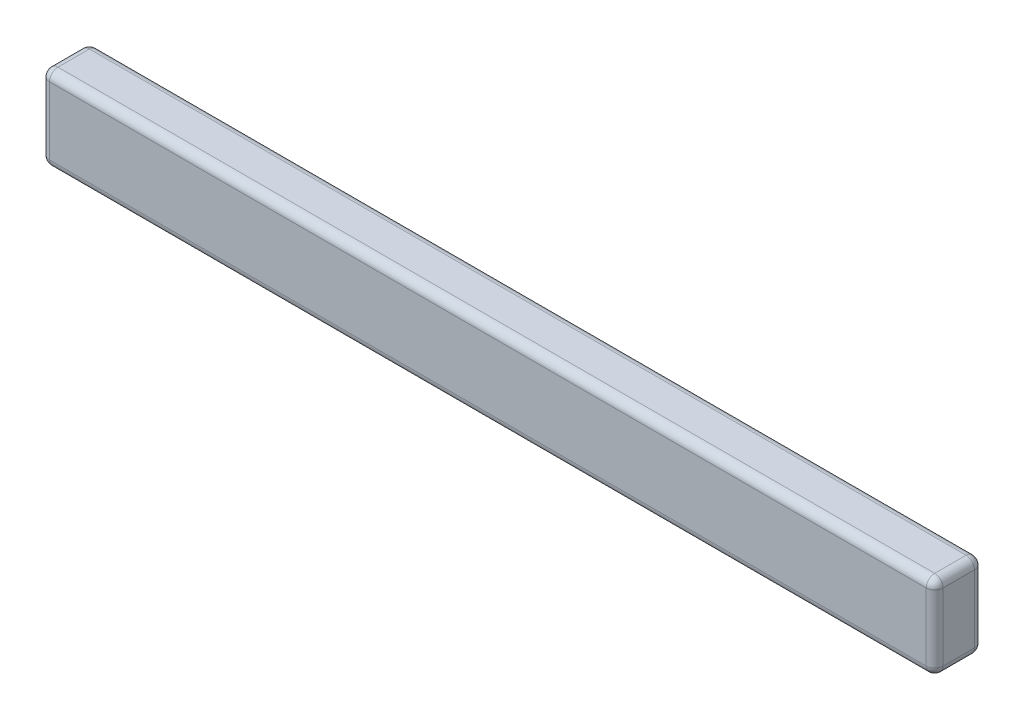
ISO-10303-21;
HEADER;
FILE_DESCRIPTION(('STEP AP214'),'2;1');
FILE_NAME('part.step','',(''),(''),'','','');
FILE_SCHEMA(('AUTOMOTIVE_DESIGN { 1 0 10303 214 1 1 1 1 }'));
ENDSEC;
DATA;
#1=APPLICATION_CONTEXT('core data for automotive mechanical design processes');
#2=APPLICATION_PROTOCOL_DEFINITION('international standard','automotive_design',2000,#1);
#3=PRODUCT_CONTEXT('',#1,'mechanical');
#4=PRODUCT('Part','Part','',(#3));
#5=PRODUCT_RELATED_PRODUCT_CATEGORY('part','',(#4));
#6=PRODUCT_DEFINITION_FORMATION('','',#4);
#7=PRODUCT_DEFINITION_CONTEXT('part definition',#1,'design');
#8=PRODUCT_DEFINITION('design','',#6,#7);
#9=PRODUCT_DEFINITION_SHAPE('','',#8);
#10=(LENGTH_UNIT() NAMED_UNIT(*) SI_UNIT(.MILLI.,.METRE.));
#11=(NAMED_UNIT(*) PLANE_ANGLE_UNIT() SI_UNIT($,.RADIAN.));
#12=(NAMED_UNIT(*) SI_UNIT($,.STERADIAN.) SOLID_ANGLE_UNIT());
#13=UNCERTAINTY_MEASURE_WITH_UNIT(LENGTH_MEASURE(1.E-05),#10,'distance_accuracy_value','');
#14=(GEOMETRIC_REPRESENTATION_CONTEXT(3) GLOBAL_UNCERTAINTY_ASSIGNED_CONTEXT((#13)) GLOBAL_UNIT_ASSIGNED_CONTEXT((#10,
#11,#12)) REPRESENTATION_CONTEXT('',''));
#15=CARTESIAN_POINT('',(0.,0.,0.));
#16=DIRECTION('',(0.,0.,1.));
#17=DIRECTION('',(1.,0.,0.));
#18=AXIS2_PLACEMENT_3D('',#15,#16,#17);
#19=CARTESIAN_POINT('',(2399.83953907813,-324.547034379125,200.));
#20=DIRECTION('',(-1.,0.,0.));
#21=DIRECTION('',(0.,0.,1.));
#22=AXIS2_PLACEMENT_3D('',#19,#20,#21);
#23=PLANE('',#22);
#24=DIRECTION('',(0.,0.,-1.));
#25=VECTOR('',#24,1.);
#26=CARTESIAN_POINT('',(2399.83953907813,-359.547034379125,200.));
#27=LINE('',#26,#25);
#28=CARTESIAN_POINT('',(2399.83953907813,-359.547034379125,35.));
#29=VERTEX_POINT('',#28);
#30=CARTESIAN_POINT('',(2399.83953907813,-359.547034379125,165.));
#31=VERTEX_POINT('',#30);
#32=EDGE_CURVE('E142',#29,#31,#27,.F.);
#33=ORIENTED_EDGE('',*,*,#32,.T.);
#34=DIRECTION('',(0.,1.,0.));
#35=VECTOR('',#34,1.);
#36=CARTESIAN_POINT('',(2399.83953907813,-674.547034379125,165.));
#37=LINE('',#36,#35);
#38=CARTESIAN_POINT('',(2399.83953907813,-639.547034379125,165.));
#39=VERTEX_POINT('',#38);
#40=EDGE_CURVE('E188',#31,#39,#37,.F.);
#41=ORIENTED_EDGE('',*,*,#40,.T.);
#42=DIRECTION('',(0.,0.,-1.));
#43=VECTOR('',#42,1.);
#44=CARTESIAN_POINT('',(2399.83953907813,-639.547034379125,200.));
#45=LINE('',#44,#43);
#46=CARTESIAN_POINT('',(2399.83953907813,-639.547034379125,35.));
#47=VERTEX_POINT('',#46);
#48=EDGE_CURVE('E183',#39,#47,#45,.T.);
#49=ORIENTED_EDGE('',*,*,#48,.T.);
#50=DIRECTION('',(0.,1.,0.));
#51=VECTOR('',#50,1.);
#52=CARTESIAN_POINT('',(2399.83953907813,-324.547034379125,35.));
#53=LINE('',#52,#51);
#54=EDGE_CURVE('E177',#47,#29,#53,.T.);
#55=ORIENTED_EDGE('',*,*,#54,.T.);
#56=EDGE_LOOP('',(#33,#41,#49,#55));
#57=FACE_BOUND('',#56,.T.);
#58=ADVANCED_FACE('F45',(#57),#23,.F.);
#59=CARTESIAN_POINT('',(-1300.16046092187,-324.547034379125,200.));
#60=DIRECTION('',(0.,-1.,0.));
#61=DIRECTION('',(1.,0.,0.));
#62=AXIS2_PLACEMENT_3D('',#59,#60,#61);
#63=PLANE('',#62);
#64=DIRECTION('',(0.,0.,-1.));
#65=VECTOR('',#64,1.);
#66=CARTESIAN_POINT('',(-1265.16046092187,-324.547034379125,200.));
#67=LINE('',#66,#65);
#68=CARTESIAN_POINT('',(-1265.16046092187,-324.547034379125,35.));
#69=VERTEX_POINT('',#68);
#70=CARTESIAN_POINT('',(-1265.16046092187,-324.547034379125,165.));
#71=VERTEX_POINT('',#70);
#72=EDGE_CURVE('E167',#69,#71,#67,.F.);
#73=ORIENTED_EDGE('',*,*,#72,.T.);
#74=DIRECTION('',(-1.,0.,0.));
#75=VECTOR('',#74,1.);
#76=CARTESIAN_POINT('',(2399.83953907813,-324.547034379125,165.));
#77=LINE('',#76,#75);
#78=CARTESIAN_POINT('',(2364.83953907813,-324.547034379125,165.));
#79=VERTEX_POINT('',#78);
#80=EDGE_CURVE('E171',#71,#79,#77,.F.);
#81=ORIENTED_EDGE('',*,*,#80,.T.);
#82=DIRECTION('',(0.,0.,-1.));
#83=VECTOR('',#82,1.);
#84=CARTESIAN_POINT('',(2364.83953907813,-324.547034379125,200.));
#85=LINE('',#84,#83);
#86=CARTESIAN_POINT('',(2364.83953907813,-324.547034379125,35.));
#87=VERTEX_POINT('',#86);
#88=EDGE_CURVE('E140',#79,#87,#85,.T.);
#89=ORIENTED_EDGE('',*,*,#88,.T.);
#90=DIRECTION('',(-1.,0.,0.));
#91=VECTOR('',#90,1.);
#92=CARTESIAN_POINT('',(-1300.16046092187,-324.547034379125,35.));
#93=LINE('',#92,#91);
#94=EDGE_CURVE('E160',#87,#69,#93,.T.);
#95=ORIENTED_EDGE('',*,*,#94,.T.);
#96=EDGE_LOOP('',(#73,#81,#89,#95));
#97=FACE_BOUND('',#96,.T.);
#98=ADVANCED_FACE('F169',(#97),#63,.F.);
#99=CARTESIAN_POINT('',(-1300.16046092187,-324.547034379125,200.));
#100=DIRECTION('',(1.,0.,0.));
#101=DIRECTION('',(0.,0.,-1.));
#102=AXIS2_PLACEMENT_3D('',#99,#100,#101);
#103=PLANE('',#102);
#104=DIRECTION('',(0.,0.,-1.));
#105=VECTOR('',#104,1.);
#106=CARTESIAN_POINT('',(-1300.16046092187,-639.547034379125,200.));
#107=LINE('',#106,#105);
#108=CARTESIAN_POINT('',(-1300.16046092187,-639.547034379125,35.));
#109=VERTEX_POINT('',#108);
#110=CARTESIAN_POINT('',(-1300.16046092187,-639.547034379125,165.));
#111=VERTEX_POINT('',#110);
#112=EDGE_CURVE('E194',#109,#111,#107,.F.);
#113=ORIENTED_EDGE('',*,*,#112,.T.);
#114=DIRECTION('',(0.,-1.,0.));
#115=VECTOR('',#114,1.);
#116=CARTESIAN_POINT('',(-1300.16046092187,-324.547034379125,165.));
#117=LINE('',#116,#115);
#118=CARTESIAN_POINT('',(-1300.16046092187,-359.547034379125,165.));
#119=VERTEX_POINT('',#118);
#120=EDGE_CURVE('E201',#111,#119,#117,.F.);
#121=ORIENTED_EDGE('',*,*,#120,.T.);
#122=DIRECTION('',(0.,0.,-1.));
#123=VECTOR('',#122,1.);
#124=CARTESIAN_POINT('',(-1300.16046092187,-359.547034379125,200.));
#125=LINE('',#124,#123);
#126=CARTESIAN_POINT('',(-1300.16046092187,-359.547034379125,35.));
#127=VERTEX_POINT('',#126);
#128=EDGE_CURVE('E197',#119,#127,#125,.T.);
#129=ORIENTED_EDGE('',*,*,#128,.T.);
#130=DIRECTION('',(0.,-1.,0.));
#131=VECTOR('',#130,1.);
#132=CARTESIAN_POINT('',(-1300.16046092187,-324.547034379125,35.));
#133=LINE('',#132,#131);
#134=EDGE_CURVE('E191',#127,#109,#133,.T.);
#135=ORIENTED_EDGE('',*,*,#134,.T.);
#136=EDGE_LOOP('',(#113,#121,#129,#135));
#137=FACE_BOUND('',#136,.T.);
#138=ADVANCED_FACE('F340',(#137),#103,.F.);
#139=CARTESIAN_POINT('',(-1300.16046092187,-674.547034379125,200.));
#140=DIRECTION('',(0.,1.,0.));
#141=DIRECTION('',(0.,0.,1.));
#142=AXIS2_PLACEMENT_3D('',#139,#140,#141);
#143=PLANE('',#142);
#144=DIRECTION('',(0.,0.,-1.));
#145=VECTOR('',#144,1.);
#146=CARTESIAN_POINT('',(2364.83953907813,-674.547034379125,200.));
#147=LINE('',#146,#145);
#148=CARTESIAN_POINT('',(2364.83953907813,-674.547034379125,35.));
#149=VERTEX_POINT('',#148);
#150=CARTESIAN_POINT('',(2364.83953907813,-674.547034379125,165.));
#151=VERTEX_POINT('',#150);
#152=EDGE_CURVE('E207',#149,#151,#147,.F.);
#153=ORIENTED_EDGE('',*,*,#152,.T.);
#154=DIRECTION('',(1.,0.,0.));
#155=VECTOR('',#154,1.);
#156=CARTESIAN_POINT('',(-1300.16046092187,-674.547034379125,165.));
#157=LINE('',#156,#155);
#158=CARTESIAN_POINT('',(-1265.16046092187,-674.547034379125,165.));
#159=VERTEX_POINT('',#158);
#160=EDGE_CURVE('E214',#151,#159,#157,.F.);
#161=ORIENTED_EDGE('',*,*,#160,.T.);
#162=DIRECTION('',(0.,0.,-1.));
#163=VECTOR('',#162,1.);
#164=CARTESIAN_POINT('',(-1265.16046092187,-674.547034379125,200.));
#165=LINE('',#164,#163);
#166=CARTESIAN_POINT('',(-1265.16046092187,-674.547034379125,35.));
#167=VERTEX_POINT('',#166);
#168=EDGE_CURVE('E210',#159,#167,#165,.T.);
#169=ORIENTED_EDGE('',*,*,#168,.T.);
#170=DIRECTION('',(1.,0.,0.));
#171=VECTOR('',#170,1.);
#172=CARTESIAN_POINT('',(-1300.16046092187,-674.547034379125,35.));
#173=LINE('',#172,#171);
#174=EDGE_CURVE('E204',#167,#149,#173,.T.);
#175=ORIENTED_EDGE('',*,*,#174,.T.);
#176=EDGE_LOOP('',(#153,#161,#169,#175));
#177=FACE_BOUND('',#176,.T.);
#178=ADVANCED_FACE('F351',(#177),#143,.F.);
#179=CARTESIAN_POINT('',(0.,0.,200.));
#180=DIRECTION('',(0.,0.,1.));
#181=DIRECTION('',(1.,0.,0.));
#182=AXIS2_PLACEMENT_3D('',#179,#180,#181);
#183=PLANE('',#182);
#184=DIRECTION('',(0.,-1.,0.));
#185=VECTOR('',#184,1.);
#186=CARTESIAN_POINT('',(-1265.16046092187,-674.547034379125,200.));
#187=LINE('',#186,#185);
#188=CARTESIAN_POINT('',(-1265.16046092187,-359.547034379125,200.));
#189=VERTEX_POINT('',#188);
#190=CARTESIAN_POINT('',(-1265.16046092187,-639.547034379125,200.));
#191=VERTEX_POINT('',#190);
#192=EDGE_CURVE('E223',#189,#191,#187,.T.);
#193=ORIENTED_EDGE('',*,*,#192,.T.);
#194=DIRECTION('',(1.,0.,0.));
#195=VECTOR('',#194,1.);
#196=CARTESIAN_POINT('',(2399.83953907813,-639.547034379125,200.));
#197=LINE('',#196,#195);
#198=CARTESIAN_POINT('',(2364.83953907813,-639.547034379125,200.));
#199=VERTEX_POINT('',#198);
#200=EDGE_CURVE('E226',#191,#199,#197,.T.);
#201=ORIENTED_EDGE('',*,*,#200,.T.);
#202=DIRECTION('',(0.,1.,0.));
#203=VECTOR('',#202,1.);
#204=CARTESIAN_POINT('',(2364.83953907813,-324.547034379125,200.));
#205=LINE('',#204,#203);
#206=CARTESIAN_POINT('',(2364.83953907813,-359.547034379125,200.));
#207=VERTEX_POINT('',#206);
#208=EDGE_CURVE('E217',#199,#207,#205,.T.);
#209=ORIENTED_EDGE('',*,*,#208,.T.);
#210=DIRECTION('',(-1.,0.,0.));
#211=VECTOR('',#210,1.);
#212=CARTESIAN_POINT('',(-1300.16046092187,-359.547034379125,200.));
#213=LINE('',#212,#211);
#214=EDGE_CURVE('E220',#207,#189,#213,.T.);
#215=ORIENTED_EDGE('',*,*,#214,.T.);
#216=EDGE_LOOP('',(#193,#201,#209,#215));
#217=FACE_BOUND('',#216,.T.);
#218=ADVANCED_FACE('F332',(#217),#183,.T.);
#219=CARTESIAN_POINT('',(0.,0.,0.));
#220=DIRECTION('',(0.,0.,1.));
#221=DIRECTION('',(1.,0.,0.));
#222=AXIS2_PLACEMENT_3D('',#219,#220,#221);
#223=PLANE('',#222);
#224=DIRECTION('',(0.,-1.,0.));
#225=VECTOR('',#224,1.);
#226=CARTESIAN_POINT('',(-1265.16046092187,0.,0.));
#227=LINE('',#226,#225);
#228=CARTESIAN_POINT('',(-1265.16046092187,-639.547034379125,0.));
#229=VERTEX_POINT('',#228);
#230=CARTESIAN_POINT('',(-1265.16046092187,-359.547034379125,0.));
#231=VERTEX_POINT('',#230);
#232=EDGE_CURVE('E55',#229,#231,#227,.F.);
#233=ORIENTED_EDGE('',*,*,#232,.T.);
#234=DIRECTION('',(-1.,0.,0.));
#235=VECTOR('',#234,1.);
#236=CARTESIAN_POINT('',(0.,-359.547034379125,0.));
#237=LINE('',#236,#235);
#238=CARTESIAN_POINT('',(2364.83953907813,-359.547034379125,0.));
#239=VERTEX_POINT('',#238);
#240=EDGE_CURVE('E11',#231,#239,#237,.F.);
#241=ORIENTED_EDGE('',*,*,#240,.T.);
#242=DIRECTION('',(0.,1.,0.));
#243=VECTOR('',#242,1.);
#244=CARTESIAN_POINT('',(2364.83953907813,0.,0.));
#245=LINE('',#244,#243);
#246=CARTESIAN_POINT('',(2364.83953907813,-639.547034379125,0.));
#247=VERTEX_POINT('',#246);
#248=EDGE_CURVE('E230',#239,#247,#245,.F.);
#249=ORIENTED_EDGE('',*,*,#248,.T.);
#250=DIRECTION('',(1.,0.,0.));
#251=VECTOR('',#250,1.);
#252=CARTESIAN_POINT('',(0.,-639.547034379125,0.));
#253=LINE('',#252,#251);
#254=EDGE_CURVE('E66',#247,#229,#253,.F.);
#255=ORIENTED_EDGE('',*,*,#254,.T.);
#256=EDGE_LOOP('',(#233,#241,#249,#255));
#257=FACE_BOUND('',#256,.T.);
#258=ADVANCED_FACE('F577',(#257),#223,.F.);
#259=CARTESIAN_POINT('',(-1265.16046092187,-639.547034379125,200.));
#260=DIRECTION('',(0.,0.,-1.));
#261=DIRECTION('',(-1.,0.,0.));
#262=AXIS2_PLACEMENT_3D('',#259,#260,#261);
#263=CYLINDRICAL_SURFACE('',#262,35.);
#264=CARTESIAN_POINT('',(-1265.16046092187,-639.547034379125,165.));
#265=DIRECTION('',(0.,0.,1.));
#266=DIRECTION('',(1.,0.,0.));
#267=AXIS2_PLACEMENT_3D('',#264,#265,#266);
#268=CIRCLE('',#267,35.);
#269=EDGE_CURVE('E49',#111,#159,#268,.T.);
#270=ORIENTED_EDGE('',*,*,#269,.F.);
#271=ORIENTED_EDGE('',*,*,#112,.F.);
#272=CARTESIAN_POINT('',(-1265.16046092187,-639.547034379125,35.));
#273=DIRECTION('',(0.,0.,-1.));
#274=DIRECTION('',(-1.,0.,0.));
#275=AXIS2_PLACEMENT_3D('',#272,#273,#274);
#276=CIRCLE('',#275,35.);
#277=EDGE_CURVE('E307',#167,#109,#276,.T.);
#278=ORIENTED_EDGE('',*,*,#277,.F.);
#279=ORIENTED_EDGE('',*,*,#168,.F.);
#280=EDGE_LOOP('',(#270,#271,#278,#279));
#281=FACE_BOUND('',#280,.T.);
#282=ADVANCED_FACE('F47',(#281),#263,.T.);
#283=CARTESIAN_POINT('',(-1265.16046092187,-639.547034379125,165.));
#284=DIRECTION('',(0.,-1.,0.));
#285=DIRECTION('',(0.,0.,-1.));
#286=AXIS2_PLACEMENT_3D('',#283,#284,#285);
#287=SPHERICAL_SURFACE('',#286,35.);
#288=CARTESIAN_POINT('',(-1265.16046092187,-639.547034379125,165.));
#289=DIRECTION('',(0.,-1.,0.));
#290=DIRECTION('',(0.,0.,-1.));
#291=AXIS2_PLACEMENT_3D('',#288,#289,#290);
#292=CIRCLE('',#291,35.);
#293=EDGE_CURVE('E300',#111,#191,#292,.F.);
#294=ORIENTED_EDGE('',*,*,#293,.F.);
#295=ORIENTED_EDGE('',*,*,#269,.T.);
#296=CARTESIAN_POINT('',(-1265.16046092187,-639.547034379125,165.));
#297=DIRECTION('',(-1.,0.,0.));
#298=DIRECTION('',(0.,0.,1.));
#299=AXIS2_PLACEMENT_3D('',#296,#297,#298);
#300=CIRCLE('',#299,35.);
#301=EDGE_CURVE('E304',#191,#159,#300,.F.);
#302=ORIENTED_EDGE('',*,*,#301,.F.);
#303=EDGE_LOOP('',(#294,#295,#302));
#304=FACE_BOUND('',#303,.T.);
#305=ADVANCED_FACE('F320',(#304),#287,.T.);
#306=CARTESIAN_POINT('',(-1265.16046092187,-639.547034379125,35.));
#307=DIRECTION('',(-1.,0.,0.));
#308=DIRECTION('',(0.,0.,1.));
#309=AXIS2_PLACEMENT_3D('',#306,#307,#308);
#310=SPHERICAL_SURFACE('',#309,35.);
#311=CARTESIAN_POINT('',(-1265.16046092187,-639.547034379125,35.));
#312=DIRECTION('',(-1.,0.,0.));
#313=DIRECTION('',(0.,0.,1.));
#314=AXIS2_PLACEMENT_3D('',#311,#312,#313);
#315=CIRCLE('',#314,35.);
#316=EDGE_CURVE('E293',#167,#229,#315,.F.);
#317=ORIENTED_EDGE('',*,*,#316,.F.);
#318=ORIENTED_EDGE('',*,*,#277,.T.);
#319=CARTESIAN_POINT('',(-1265.16046092187,-639.547034379125,35.));
#320=DIRECTION('',(0.,-1.,0.));
#321=DIRECTION('',(0.,0.,-1.));
#322=AXIS2_PLACEMENT_3D('',#319,#320,#321);
#323=CIRCLE('',#322,35.);
#324=EDGE_CURVE('E296',#229,#109,#323,.F.);
#325=ORIENTED_EDGE('',*,*,#324,.F.);
#326=EDGE_LOOP('',(#317,#318,#325));
#327=FACE_BOUND('',#326,.T.);
#328=ADVANCED_FACE('F550',(#327),#310,.T.);
#329=CARTESIAN_POINT('',(0.,-639.547034379125,165.));
#330=DIRECTION('',(-1.,0.,0.));
#331=DIRECTION('',(0.,0.,1.));
#332=AXIS2_PLACEMENT_3D('',#329,#330,#331);
#333=CYLINDRICAL_SURFACE('',#332,35.);
#334=ORIENTED_EDGE('',*,*,#301,.T.);
#335=ORIENTED_EDGE('',*,*,#160,.F.);
#336=CARTESIAN_POINT('',(2364.83953907813,-639.547034379125,165.));
#337=DIRECTION('',(1.,0.,0.));
#338=DIRECTION('',(0.,0.,-1.));
#339=AXIS2_PLACEMENT_3D('',#336,#337,#338);
#340=CIRCLE('',#339,35.);
#341=EDGE_CURVE('E285',#199,#151,#340,.T.);
#342=ORIENTED_EDGE('',*,*,#341,.F.);
#343=ORIENTED_EDGE('',*,*,#200,.F.);
#344=EDGE_LOOP('',(#334,#335,#342,#343));
#345=FACE_BOUND('',#344,.T.);
#346=ADVANCED_FACE('F328',(#345),#333,.T.);
#347=CARTESIAN_POINT('',(-1265.16046092187,0.,165.));
#348=DIRECTION('',(0.,1.,0.));
#349=DIRECTION('',(0.,0.,1.));
#350=AXIS2_PLACEMENT_3D('',#347,#348,#349);
#351=CYLINDRICAL_SURFACE('',#350,35.);
#352=ORIENTED_EDGE('',*,*,#293,.T.);
#353=ORIENTED_EDGE('',*,*,#192,.F.);
#354=CARTESIAN_POINT('',(-1265.16046092187,-359.547034379125,165.));
#355=DIRECTION('',(0.,1.,0.));
#356=DIRECTION('',(0.,0.,1.));
#357=AXIS2_PLACEMENT_3D('',#354,#355,#356);
#358=CIRCLE('',#357,35.);
#359=EDGE_CURVE('E281',#119,#189,#358,.T.);
#360=ORIENTED_EDGE('',*,*,#359,.F.);
#361=ORIENTED_EDGE('',*,*,#120,.F.);
#362=EDGE_LOOP('',(#352,#353,#360,#361));
#363=FACE_BOUND('',#362,.T.);
#364=ADVANCED_FACE('F337',(#363),#351,.T.);
#365=CARTESIAN_POINT('',(-1265.16046092187,-359.547034379125,200.));
#366=DIRECTION('',(0.,0.,-1.));
#367=DIRECTION('',(-1.,0.,0.));
#368=AXIS2_PLACEMENT_3D('',#365,#366,#367);
#369=CYLINDRICAL_SURFACE('',#368,35.);
#370=CARTESIAN_POINT('',(-1265.16046092187,-359.547034379125,35.));
#371=DIRECTION('',(0.,0.,-1.));
#372=DIRECTION('',(-1.,0.,0.));
#373=AXIS2_PLACEMENT_3D('',#370,#371,#372);
#374=CIRCLE('',#373,35.);
#375=EDGE_CURVE('E273',#127,#69,#374,.T.);
#376=ORIENTED_EDGE('',*,*,#375,.F.);
#377=ORIENTED_EDGE('',*,*,#128,.F.);
#378=CARTESIAN_POINT('',(-1265.16046092187,-359.547034379125,165.));
#379=DIRECTION('',(0.,0.,1.));
#380=DIRECTION('',(1.,0.,0.));
#381=AXIS2_PLACEMENT_3D('',#378,#379,#380);
#382=CIRCLE('',#381,35.);
#383=EDGE_CURVE('E277',#71,#119,#382,.T.);
#384=ORIENTED_EDGE('',*,*,#383,.F.);
#385=ORIENTED_EDGE('',*,*,#72,.F.);
#386=EDGE_LOOP('',(#376,#377,#384,#385));
#387=FACE_BOUND('',#386,.T.);
#388=ADVANCED_FACE('F344',(#387),#369,.T.);
#389=CARTESIAN_POINT('',(-1265.16046092187,-324.547034379125,35.));
#390=DIRECTION('',(0.,-1.,0.));
#391=DIRECTION('',(0.,0.,-1.));
#392=AXIS2_PLACEMENT_3D('',#389,#390,#391);
#393=CYLINDRICAL_SURFACE('',#392,35.);
#394=ORIENTED_EDGE('',*,*,#324,.T.);
#395=ORIENTED_EDGE('',*,*,#134,.F.);
#396=CARTESIAN_POINT('',(-1265.16046092187,-359.547034379125,35.));
#397=DIRECTION('',(0.,1.,0.));
#398=DIRECTION('',(0.,0.,1.));
#399=AXIS2_PLACEMENT_3D('',#396,#397,#398);
#400=CIRCLE('',#399,35.);
#401=EDGE_CURVE('E270',#231,#127,#400,.T.);
#402=ORIENTED_EDGE('',*,*,#401,.F.);
#403=ORIENTED_EDGE('',*,*,#232,.F.);
#404=EDGE_LOOP('',(#394,#395,#402,#403));
#405=FACE_BOUND('',#404,.T.);
#406=ADVANCED_FACE('F349',(#405),#393,.T.);
#407=CARTESIAN_POINT('',(-1300.16046092187,-639.547034379125,35.));
#408=DIRECTION('',(1.,0.,0.));
#409=DIRECTION('',(0.,0.,-1.));
#410=AXIS2_PLACEMENT_3D('',#407,#408,#409);
#411=CYLINDRICAL_SURFACE('',#410,35.);
#412=ORIENTED_EDGE('',*,*,#316,.T.);
#413=ORIENTED_EDGE('',*,*,#254,.F.);
#414=CARTESIAN_POINT('',(2364.83953907813,-639.547034379125,35.));
#415=DIRECTION('',(1.,0.,0.));
#416=DIRECTION('',(0.,0.,-1.));
#417=AXIS2_PLACEMENT_3D('',#414,#415,#416);
#418=CIRCLE('',#417,35.);
#419=EDGE_CURVE('E266',#149,#247,#418,.T.);
#420=ORIENTED_EDGE('',*,*,#419,.F.);
#421=ORIENTED_EDGE('',*,*,#174,.F.);
#422=EDGE_LOOP('',(#412,#413,#420,#421));
#423=FACE_BOUND('',#422,.T.);
#424=ADVANCED_FACE('F360',(#423),#411,.T.);
#425=CARTESIAN_POINT('',(2364.83953907813,-639.547034379125,200.));
#426=DIRECTION('',(0.,0.,-1.));
#427=DIRECTION('',(-1.,0.,0.));
#428=AXIS2_PLACEMENT_3D('',#425,#426,#427);
#429=CYLINDRICAL_SURFACE('',#428,35.);
#430=CARTESIAN_POINT('',(2364.83953907813,-639.547034379125,165.));
#431=DIRECTION('',(0.,0.,1.));
#432=DIRECTION('',(1.,0.,0.));
#433=AXIS2_PLACEMENT_3D('',#430,#431,#432);
#434=CIRCLE('',#433,35.);
#435=EDGE_CURVE('E289',#151,#39,#434,.T.);
#436=ORIENTED_EDGE('',*,*,#435,.F.);
#437=ORIENTED_EDGE('',*,*,#152,.F.);
#438=CARTESIAN_POINT('',(2364.83953907813,-639.547034379125,35.));
#439=DIRECTION('',(0.,0.,-1.));
#440=DIRECTION('',(-1.,0.,0.));
#441=AXIS2_PLACEMENT_3D('',#438,#439,#440);
#442=CIRCLE('',#441,35.);
#443=EDGE_CURVE('E262',#47,#149,#442,.T.);
#444=ORIENTED_EDGE('',*,*,#443,.F.);
#445=ORIENTED_EDGE('',*,*,#48,.F.);
#446=EDGE_LOOP('',(#436,#437,#444,#445));
#447=FACE_BOUND('',#446,.T.);
#448=ADVANCED_FACE('F356',(#447),#429,.T.);
#449=CARTESIAN_POINT('',(2364.83953907813,-639.547034379125,165.));
#450=DIRECTION('',(0.,-1.,0.));
#451=DIRECTION('',(0.,0.,-1.));
#452=AXIS2_PLACEMENT_3D('',#449,#450,#451);
#453=SPHERICAL_SURFACE('',#452,35.);
#454=ORIENTED_EDGE('',*,*,#341,.T.);
#455=ORIENTED_EDGE('',*,*,#435,.T.);
#456=CARTESIAN_POINT('',(2364.83953907813,-639.547034379125,165.));
#457=DIRECTION('',(0.,-1.,0.));
#458=DIRECTION('',(0.,0.,-1.));
#459=AXIS2_PLACEMENT_3D('',#456,#457,#458);
#460=CIRCLE('',#459,35.);
#461=EDGE_CURVE('E258',#199,#39,#460,.F.);
#462=ORIENTED_EDGE('',*,*,#461,.F.);
#463=EDGE_LOOP('',(#454,#455,#462));
#464=FACE_BOUND('',#463,.T.);
#465=ADVANCED_FACE('F370',(#464),#453,.T.);
#466=CARTESIAN_POINT('',(-1265.16046092187,-359.547034379125,165.));
#467=DIRECTION('',(-1.,0.,0.));
#468=DIRECTION('',(0.,0.,1.));
#469=AXIS2_PLACEMENT_3D('',#466,#467,#468);
#470=SPHERICAL_SURFACE('',#469,35.);
#471=ORIENTED_EDGE('',*,*,#383,.T.);
#472=ORIENTED_EDGE('',*,*,#359,.T.);
#473=CARTESIAN_POINT('',(-1265.16046092187,-359.547034379125,165.));
#474=DIRECTION('',(-1.,0.,0.));
#475=DIRECTION('',(0.,0.,1.));
#476=AXIS2_PLACEMENT_3D('',#473,#474,#475);
#477=CIRCLE('',#476,35.);
#478=EDGE_CURVE('E254',#71,#189,#477,.F.);
#479=ORIENTED_EDGE('',*,*,#478,.F.);
#480=EDGE_LOOP('',(#471,#472,#479));
#481=FACE_BOUND('',#480,.T.);
#482=ADVANCED_FACE('F380',(#481),#470,.T.);
#483=CARTESIAN_POINT('',(-1265.16046092187,-359.547034379125,35.));
#484=DIRECTION('',(-1.,0.,0.));
#485=DIRECTION('',(0.,0.,1.));
#486=AXIS2_PLACEMENT_3D('',#483,#484,#485);
#487=SPHERICAL_SURFACE('',#486,35.);
#488=ORIENTED_EDGE('',*,*,#401,.T.);
#489=ORIENTED_EDGE('',*,*,#375,.T.);
#490=CARTESIAN_POINT('',(-1265.16046092187,-359.547034379125,35.));
#491=DIRECTION('',(-1.,0.,0.));
#492=DIRECTION('',(0.,0.,1.));
#493=AXIS2_PLACEMENT_3D('',#490,#491,#492);
#494=CIRCLE('',#493,35.);
#495=EDGE_CURVE('E163',#231,#69,#494,.F.);
#496=ORIENTED_EDGE('',*,*,#495,.F.);
#497=EDGE_LOOP('',(#488,#489,#496));
#498=FACE_BOUND('',#497,.T.);
#499=ADVANCED_FACE('F382',(#498),#487,.T.);
#500=CARTESIAN_POINT('',(2364.83953907813,-639.547034379125,35.));
#501=DIRECTION('',(0.,-1.,0.));
#502=DIRECTION('',(0.,0.,-1.));
#503=AXIS2_PLACEMENT_3D('',#500,#501,#502);
#504=SPHERICAL_SURFACE('',#503,35.);
#505=ORIENTED_EDGE('',*,*,#443,.T.);
#506=ORIENTED_EDGE('',*,*,#419,.T.);
#507=CARTESIAN_POINT('',(2364.83953907813,-639.547034379125,35.));
#508=DIRECTION('',(0.,-1.,0.));
#509=DIRECTION('',(0.,0.,-1.));
#510=AXIS2_PLACEMENT_3D('',#507,#508,#509);
#511=CIRCLE('',#510,35.);
#512=EDGE_CURVE('E248',#47,#247,#511,.F.);
#513=ORIENTED_EDGE('',*,*,#512,.F.);
#514=EDGE_LOOP('',(#505,#506,#513));
#515=FACE_BOUND('',#514,.T.);
#516=ADVANCED_FACE('F362',(#515),#504,.T.);
#517=CARTESIAN_POINT('',(2364.83953907813,0.,165.));
#518=DIRECTION('',(0.,-1.,0.));
#519=DIRECTION('',(0.,0.,-1.));
#520=AXIS2_PLACEMENT_3D('',#517,#518,#519);
#521=CYLINDRICAL_SURFACE('',#520,35.);
#522=ORIENTED_EDGE('',*,*,#461,.T.);
#523=ORIENTED_EDGE('',*,*,#40,.F.);
#524=CARTESIAN_POINT('',(2364.83953907813,-359.547034379125,165.));
#525=DIRECTION('',(0.,1.,0.));
#526=DIRECTION('',(0.,0.,1.));
#527=AXIS2_PLACEMENT_3D('',#524,#525,#526);
#528=CIRCLE('',#527,35.);
#529=EDGE_CURVE('E244',#207,#31,#528,.T.);
#530=ORIENTED_EDGE('',*,*,#529,.F.);
#531=ORIENTED_EDGE('',*,*,#208,.F.);
#532=EDGE_LOOP('',(#522,#523,#530,#531));
#533=FACE_BOUND('',#532,.T.);
#534=ADVANCED_FACE('F372',(#533),#521,.T.);
#535=CARTESIAN_POINT('',(0.,-359.547034379125,165.));
#536=DIRECTION('',(1.,0.,0.));
#537=DIRECTION('',(0.,1.,0.));
#538=AXIS2_PLACEMENT_3D('',#535,#536,#537);
#539=CYLINDRICAL_SURFACE('',#538,35.);
#540=ORIENTED_EDGE('',*,*,#478,.T.);
#541=ORIENTED_EDGE('',*,*,#214,.F.);
#542=CARTESIAN_POINT('',(2364.83953907813,-359.547034379125,165.));
#543=DIRECTION('',(1.,0.,0.));
#544=DIRECTION('',(0.,0.,-1.));
#545=AXIS2_PLACEMENT_3D('',#542,#543,#544);
#546=CIRCLE('',#545,35.);
#547=EDGE_CURVE('E157',#79,#207,#546,.T.);
#548=ORIENTED_EDGE('',*,*,#547,.F.);
#549=ORIENTED_EDGE('',*,*,#80,.F.);
#550=EDGE_LOOP('',(#540,#541,#548,#549));
#551=FACE_BOUND('',#550,.T.);
#552=ADVANCED_FACE('F378',(#551),#539,.T.);
#553=CARTESIAN_POINT('',(-1300.16046092187,-359.547034379125,35.));
#554=DIRECTION('',(-1.,0.,0.));
#555=DIRECTION('',(0.,-1.,0.));
#556=AXIS2_PLACEMENT_3D('',#553,#554,#555);
#557=CYLINDRICAL_SURFACE('',#556,35.);
#558=ORIENTED_EDGE('',*,*,#495,.T.);
#559=ORIENTED_EDGE('',*,*,#94,.F.);
#560=CARTESIAN_POINT('',(2364.83953907813,-359.547034379125,35.));
#561=DIRECTION('',(1.,0.,0.));
#562=DIRECTION('',(0.,0.,-1.));
#563=AXIS2_PLACEMENT_3D('',#560,#561,#562);
#564=CIRCLE('',#563,35.);
#565=EDGE_CURVE('E148',#239,#87,#564,.T.);
#566=ORIENTED_EDGE('',*,*,#565,.F.);
#567=ORIENTED_EDGE('',*,*,#240,.F.);
#568=EDGE_LOOP('',(#558,#559,#566,#567));
#569=FACE_BOUND('',#568,.T.);
#570=ADVANCED_FACE('F161',(#569),#557,.T.);
#571=CARTESIAN_POINT('',(2364.83953907813,-324.547034379125,35.));
#572=DIRECTION('',(0.,1.,0.));
#573=DIRECTION('',(0.,0.,1.));
#574=AXIS2_PLACEMENT_3D('',#571,#572,#573);
#575=CYLINDRICAL_SURFACE('',#574,35.);
#576=ORIENTED_EDGE('',*,*,#512,.T.);
#577=ORIENTED_EDGE('',*,*,#248,.F.);
#578=CARTESIAN_POINT('',(2364.83953907813,-359.547034379125,35.));
#579=DIRECTION('',(0.,1.,0.));
#580=DIRECTION('',(0.,0.,1.));
#581=AXIS2_PLACEMENT_3D('',#578,#579,#580);
#582=CIRCLE('',#581,35.);
#583=EDGE_CURVE('E152',#29,#239,#582,.T.);
#584=ORIENTED_EDGE('',*,*,#583,.F.);
#585=ORIENTED_EDGE('',*,*,#54,.F.);
#586=EDGE_LOOP('',(#576,#577,#584,#585));
#587=FACE_BOUND('',#586,.T.);
#588=ADVANCED_FACE('F365',(#587),#575,.T.);
#589=CARTESIAN_POINT('',(2364.83953907813,-359.547034379125,165.));
#590=DIRECTION('',(0.,0.,1.));
#591=DIRECTION('',(1.,0.,0.));
#592=AXIS2_PLACEMENT_3D('',#589,#590,#591);
#593=SPHERICAL_SURFACE('',#592,35.);
#594=ORIENTED_EDGE('',*,*,#547,.T.);
#595=ORIENTED_EDGE('',*,*,#529,.T.);
#596=CARTESIAN_POINT('',(2364.83953907813,-359.547034379125,165.));
#597=DIRECTION('',(0.,0.,1.));
#598=DIRECTION('',(1.,0.,0.));
#599=AXIS2_PLACEMENT_3D('',#596,#597,#598);
#600=CIRCLE('',#599,35.);
#601=EDGE_CURVE('E145',#79,#31,#600,.F.);
#602=ORIENTED_EDGE('',*,*,#601,.F.);
#603=EDGE_LOOP('',(#594,#595,#602));
#604=FACE_BOUND('',#603,.T.);
#605=ADVANCED_FACE('F376',(#604),#593,.T.);
#606=CARTESIAN_POINT('',(2364.83953907813,-359.547034379125,35.));
#607=DIRECTION('',(0.,0.,-1.));
#608=DIRECTION('',(-1.,0.,0.));
#609=AXIS2_PLACEMENT_3D('',#606,#607,#608);
#610=SPHERICAL_SURFACE('',#609,35.);
#611=ORIENTED_EDGE('',*,*,#583,.T.);
#612=ORIENTED_EDGE('',*,*,#565,.T.);
#613=CARTESIAN_POINT('',(2364.83953907813,-359.547034379125,35.));
#614=DIRECTION('',(0.,0.,-1.));
#615=DIRECTION('',(-1.,0.,0.));
#616=AXIS2_PLACEMENT_3D('',#613,#614,#615);
#617=CIRCLE('',#616,35.);
#618=EDGE_CURVE('E136',#29,#87,#617,.F.);
#619=ORIENTED_EDGE('',*,*,#618,.F.);
#620=EDGE_LOOP('',(#611,#612,#619));
#621=FACE_BOUND('',#620,.T.);
#622=ADVANCED_FACE('F150',(#621),#610,.T.);
#623=CARTESIAN_POINT('',(2364.83953907813,-359.547034379125,200.));
#624=DIRECTION('',(0.,0.,-1.));
#625=DIRECTION('',(-1.,0.,0.));
#626=AXIS2_PLACEMENT_3D('',#623,#624,#625);
#627=CYLINDRICAL_SURFACE('',#626,35.);
#628=ORIENTED_EDGE('',*,*,#601,.T.);
#629=ORIENTED_EDGE('',*,*,#32,.F.);
#630=ORIENTED_EDGE('',*,*,#618,.T.);
#631=ORIENTED_EDGE('',*,*,#88,.F.);
#632=EDGE_LOOP('',(#628,#629,#630,#631));
#633=FACE_BOUND('',#632,.T.);
#634=ADVANCED_FACE('F138',(#633),#627,.T.);
#635=CLOSED_SHELL('',(#58,#98,#138,#178,#218,#258,#282,#305,#328,#346,#364,#388,#406,#424,#448,
#465,#482,#499,#516,#534,#552,#570,#588,#605,#622,#634));
#636=MANIFOLD_SOLID_BREP('B2',#635);
#637=ADVANCED_BREP_SHAPE_REPRESENTATION('',(#18,#636),#14);
#638=SHAPE_DEFINITION_REPRESENTATION(#9,#637);
ENDSEC;
END-ISO-10303-21;
